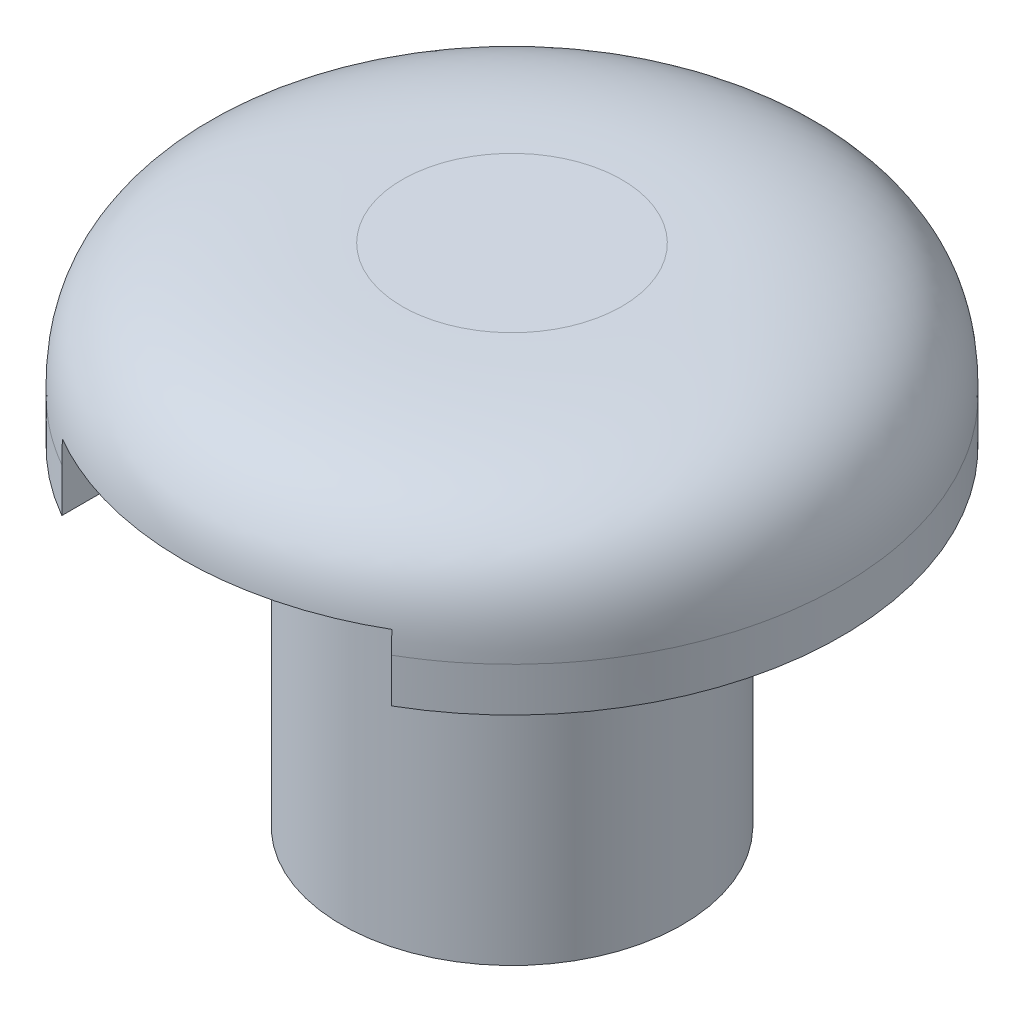
ISO-10303-21;
HEADER;
FILE_DESCRIPTION(('STEP AP214'),'2;1');
FILE_NAME('part.step','',(''),(''),'','','');
FILE_SCHEMA(('AUTOMOTIVE_DESIGN { 1 0 10303 214 1 1 1 1 }'));
ENDSEC;
DATA;
#1=APPLICATION_CONTEXT('core data for automotive mechanical design processes');
#2=APPLICATION_PROTOCOL_DEFINITION('international standard','automotive_design',2000,#1);
#3=PRODUCT_CONTEXT('',#1,'mechanical');
#4=PRODUCT('Part','Part','',(#3));
#5=PRODUCT_RELATED_PRODUCT_CATEGORY('part','',(#4));
#6=PRODUCT_DEFINITION_FORMATION('','',#4);
#7=PRODUCT_DEFINITION_CONTEXT('part definition',#1,'design');
#8=PRODUCT_DEFINITION('design','',#6,#7);
#9=PRODUCT_DEFINITION_SHAPE('','',#8);
#10=(LENGTH_UNIT() NAMED_UNIT(*) SI_UNIT(.MILLI.,.METRE.));
#11=(NAMED_UNIT(*) PLANE_ANGLE_UNIT() SI_UNIT($,.RADIAN.));
#12=(NAMED_UNIT(*) SI_UNIT($,.STERADIAN.) SOLID_ANGLE_UNIT());
#13=UNCERTAINTY_MEASURE_WITH_UNIT(LENGTH_MEASURE(1.E-05),#10,'distance_accuracy_value','');
#14=(GEOMETRIC_REPRESENTATION_CONTEXT(3) GLOBAL_UNCERTAINTY_ASSIGNED_CONTEXT((#13)) GLOBAL_UNIT_ASSIGNED_CONTEXT((#10,
#11,#12)) REPRESENTATION_CONTEXT('',''));
#15=CARTESIAN_POINT('',(0.,0.,0.));
#16=DIRECTION('',(0.,0.,1.));
#17=DIRECTION('',(1.,0.,0.));
#18=AXIS2_PLACEMENT_3D('',#15,#16,#17);
#19=CARTESIAN_POINT('',(0.,8.,0.));
#20=DIRECTION('',(0.,-1.,0.));
#21=DIRECTION('',(0.,0.,-1.));
#22=AXIS2_PLACEMENT_3D('',#19,#20,#21);
#23=CYLINDRICAL_SURFACE('',#22,15.);
#24=CARTESIAN_POINT('',(0.,2.,15.));
#25=CARTESIAN_POINT('',(1.96323118707497,2.,15.));
#26=CARTESIAN_POINT('',(5.88969356122492,2.,14.2189780737307));
#27=CARTESIAN_POINT('',(10.8827346679584,2.,10.8827346679584));
#28=CARTESIAN_POINT('',(14.2189780737307,2.,5.8896935612249));
#29=CARTESIAN_POINT('',(15.3905109631347,2.,0.));
#30=CARTESIAN_POINT('',(14.2189780737307,2.,-5.88969356122492));
#31=CARTESIAN_POINT('',(10.8827346679584,2.,-10.8827346679584));
#32=CARTESIAN_POINT('',(5.88969356122496,2.,-14.2189780737307));
#33=CARTESIAN_POINT('',(0.,2.,-15.3905109631347));
#34=CARTESIAN_POINT('',(-5.88969356122487,2.,-14.2189780737307));
#35=CARTESIAN_POINT('',(-10.8827346679585,2.,-10.8827346679584));
#36=CARTESIAN_POINT('',(-14.2189780737307,2.,-5.88969356122496));
#37=CARTESIAN_POINT('',(-15.3905109631347,2.,0.));
#38=CARTESIAN_POINT('',(-14.2189780737307,2.,5.88969356122487));
#39=CARTESIAN_POINT('',(-10.8827346679585,2.,10.8827346679584));
#40=CARTESIAN_POINT('',(-5.88969356122493,2.,14.2189780737307));
#41=CARTESIAN_POINT('',(-1.96323118707497,2.,15.));
#42=CARTESIAN_POINT('',(0.,2.,15.));
#43=B_SPLINE_CURVE_WITH_KNOTS('',3,(#24,#25,#26,#27,#28,#29,#30,#31,#32,#33,#34,#35,#36,#37,#38,
#39,#40,#41,#42),.UNSPECIFIED.,.T.,.F.,(4,1,1,1,1,1,1,1,1,1,1,1,1,1,1,1,4),(0.,
0.392699081698724,0.785398163397448,1.17809724509617,1.5707963267949,1.96349540849362,
2.35619449019234,2.74889357189107,3.14159265358979,3.53429173528852,3.92699081698724,
4.31968989868597,4.71238898038469,5.10508806208341,5.49778714378214,5.89048622548086,
6.28318530717959),.UNSPECIFIED.);
#44=CARTESIAN_POINT('',(-7.49999993406031,2.,12.9897213749177));
#45=VERTEX_POINT('',#44);
#46=CARTESIAN_POINT('',(7.49999993406189,2.,12.989721374916));
#47=VERTEX_POINT('',#46);
#48=EDGE_CURVE('E190',#45,#47,#43,.F.);
#49=ORIENTED_EDGE('',*,*,#48,.T.);
#50=DIRECTION('',(0.,-1.,0.));
#51=VECTOR('',#50,1.);
#52=CARTESIAN_POINT('',(7.5,8.,12.9903810567666));
#53=LINE('',#52,#51);
#54=CARTESIAN_POINT('',(7.5,0.,12.9903810567666));
#55=VERTEX_POINT('',#54);
#56=EDGE_CURVE('E146',#47,#55,#53,.T.);
#57=ORIENTED_EDGE('',*,*,#56,.T.);
#58=CARTESIAN_POINT('',(0.,0.,0.));
#59=DIRECTION('',(0.,1.,0.));
#60=DIRECTION('',(0.,0.,1.));
#61=AXIS2_PLACEMENT_3D('',#58,#59,#60);
#62=CIRCLE('',#61,15.);
#63=CARTESIAN_POINT('',(-7.5,0.,12.9903810567666));
#64=VERTEX_POINT('',#63);
#65=EDGE_CURVE('E151',#55,#64,#62,.T.);
#66=ORIENTED_EDGE('',*,*,#65,.T.);
#67=DIRECTION('',(0.,-1.,0.));
#68=VECTOR('',#67,1.);
#69=CARTESIAN_POINT('',(-7.5,8.,12.9903810567666));
#70=LINE('',#69,#68);
#71=EDGE_CURVE('E138',#64,#45,#70,.F.);
#72=ORIENTED_EDGE('',*,*,#71,.T.);
#73=EDGE_LOOP('',(#49,#57,#66,#72));
#74=FACE_BOUND('',#73,.T.);
#75=ADVANCED_FACE('F37',(#74),#23,.T.);
#76=CARTESIAN_POINT('',(0.,8.,0.));
#77=DIRECTION('',(0.,1.,0.));
#78=DIRECTION('',(0.,0.,1.));
#79=AXIS2_PLACEMENT_3D('',#76,#77,#78);
#80=PLANE('',#79);
#81=CARTESIAN_POINT('',(0.,8.,5.));
#82=CARTESIAN_POINT('',(-0.654410395691658,8.,5.));
#83=CARTESIAN_POINT('',(-1.96323118707498,8.,4.73965935791023));
#84=CARTESIAN_POINT('',(-3.62757822265282,8.,3.6275782226528));
#85=CARTESIAN_POINT('',(-4.73965935791023,8.,1.96323118707496));
#86=CARTESIAN_POINT('',(-5.13017032104489,8.,0.));
#87=CARTESIAN_POINT('',(-4.73965935791022,8.,-1.96323118707499));
#88=CARTESIAN_POINT('',(-3.62757822265281,8.,-3.6275782226528));
#89=CARTESIAN_POINT('',(-1.96323118707496,8.,-4.73965935791023));
#90=CARTESIAN_POINT('',(0.,8.,-5.13017032104488));
#91=CARTESIAN_POINT('',(1.96323118707499,8.00000000000001,-4.73965935791022));
#92=CARTESIAN_POINT('',(3.6275782226528,8.,-3.62757822265281));
#93=CARTESIAN_POINT('',(4.73965935791023,8.,-1.96323118707497));
#94=CARTESIAN_POINT('',(5.13017032104488,8.,0.));
#95=CARTESIAN_POINT('',(4.73965935791023,8.,1.96323118707497));
#96=CARTESIAN_POINT('',(3.62757822265281,8.,3.62757822265281));
#97=CARTESIAN_POINT('',(1.96323118707497,8.,4.73965935791023));
#98=CARTESIAN_POINT('',(0.654410395691658,8.,5.));
#99=CARTESIAN_POINT('',(0.,8.,5.));
#100=B_SPLINE_CURVE_WITH_KNOTS('',3,(#81,#82,#83,#84,#85,#86,#87,#88,#89,#90,#91,#92,#93,#94,
#95,#96,#97,#98,#99),.UNSPECIFIED.,.T.,.F.,(4,1,1,1,1,1,1,1,1,1,1,1,1,1,1,1,4),(0.,
0.392699081698724,0.785398163397448,1.17809724509617,1.5707963267949,1.96349540849362,
2.35619449019235,2.74889357189107,3.14159265358979,3.53429173528852,3.92699081698724,
4.31968989868597,4.71238898038469,5.10508806208341,5.49778714378214,5.89048622548086,
6.28318530717959),.UNSPECIFIED.);
#101=CARTESIAN_POINT('',(0.,8.,5.));
#102=VERTEX_POINT('',#101);
#103=EDGE_CURVE('E156',#102,#102,#100,.F.);
#104=ORIENTED_EDGE('',*,*,#103,.T.);
#105=EDGE_LOOP('',(#104));
#106=FACE_BOUND('',#105,.T.);
#107=ADVANCED_FACE('F168',(#106),#80,.T.);
#108=CARTESIAN_POINT('',(0.,0.,0.));
#109=DIRECTION('',(0.,1.,0.));
#110=DIRECTION('',(0.,0.,1.));
#111=AXIS2_PLACEMENT_3D('',#108,#109,#110);
#112=PLANE('',#111);
#113=CARTESIAN_POINT('',(11.5,0.,0.));
#114=DIRECTION('',(0.,-1.,0.));
#115=DIRECTION('',(0.,0.,-1.));
#116=AXIS2_PLACEMENT_3D('',#113,#114,#115);
#117=CIRCLE('',#116,3.);
#118=CARTESIAN_POINT('',(11.5,0.,-3.));
#119=VERTEX_POINT('',#118);
#120=EDGE_CURVE('E127',#119,#119,#117,.T.);
#121=ORIENTED_EDGE('',*,*,#120,.F.);
#122=EDGE_LOOP('',(#121));
#123=FACE_BOUND('',#122,.T.);
#124=CARTESIAN_POINT('',(-11.5,0.,0.));
#125=DIRECTION('',(0.,-1.,0.));
#126=DIRECTION('',(0.,0.,-1.));
#127=AXIS2_PLACEMENT_3D('',#124,#125,#126);
#128=CIRCLE('',#127,3.);
#129=CARTESIAN_POINT('',(-11.5,0.,-3.));
#130=VERTEX_POINT('',#129);
#131=EDGE_CURVE('E257',#130,#130,#128,.T.);
#132=ORIENTED_EDGE('',*,*,#131,.F.);
#133=EDGE_LOOP('',(#132));
#134=FACE_BOUND('',#133,.T.);
#135=CARTESIAN_POINT('',(0.,0.,0.));
#136=DIRECTION('',(0.,-1.,0.));
#137=DIRECTION('',(0.,0.,-1.));
#138=AXIS2_PLACEMENT_3D('',#135,#136,#137);
#139=CIRCLE('',#138,7.75);
#140=CARTESIAN_POINT('',(-3.32603367391252,0.,7.));
#141=VERTEX_POINT('',#140);
#142=CARTESIAN_POINT('',(3.32603367391252,0.,7.));
#143=VERTEX_POINT('',#142);
#144=EDGE_CURVE('E12',#141,#143,#139,.T.);
#145=ORIENTED_EDGE('',*,*,#144,.F.);
#146=DIRECTION('',(1.,0.,0.));
#147=VECTOR('',#146,1.);
#148=CARTESIAN_POINT('',(-7.5,0.,7.));
#149=LINE('',#148,#147);
#150=CARTESIAN_POINT('',(-7.5,0.,7.));
#151=VERTEX_POINT('',#150);
#152=EDGE_CURVE('E108',#151,#141,#149,.T.);
#153=ORIENTED_EDGE('',*,*,#152,.F.);
#154=DIRECTION('',(0.,0.,1.));
#155=VECTOR('',#154,1.);
#156=CARTESIAN_POINT('',(-7.5,0.,7.));
#157=LINE('',#156,#155);
#158=EDGE_CURVE('E140',#151,#64,#157,.T.);
#159=ORIENTED_EDGE('',*,*,#158,.T.);
#160=ORIENTED_EDGE('',*,*,#65,.F.);
#161=DIRECTION('',(0.,0.,1.));
#162=VECTOR('',#161,1.);
#163=CARTESIAN_POINT('',(7.5,0.,7.));
#164=LINE('',#163,#162);
#165=CARTESIAN_POINT('',(7.5,0.,7.));
#166=VERTEX_POINT('',#165);
#167=EDGE_CURVE('E116',#166,#55,#164,.T.);
#168=ORIENTED_EDGE('',*,*,#167,.F.);
#169=EDGE_CURVE('E105',#143,#166,#149,.T.);
#170=ORIENTED_EDGE('',*,*,#169,.F.);
#171=EDGE_LOOP('',(#145,#153,#159,#160,#168,#170));
#172=FACE_BOUND('',#171,.T.);
#173=ADVANCED_FACE('F114',(#123,#134,#172),#112,.F.);
#174=CARTESIAN_POINT('',(0.,8.,5.));
#175=CARTESIAN_POINT('',(0.654410395691658,8.,5.));
#176=CARTESIAN_POINT('',(1.96323118707497,8.,4.73965935791023));
#177=CARTESIAN_POINT('',(3.62757822265281,8.,3.62757822265281));
#178=CARTESIAN_POINT('',(4.73965935791023,8.,1.96323118707497));
#179=CARTESIAN_POINT('',(5.13017032104488,8.,0.));
#180=CARTESIAN_POINT('',(4.73965935791023,8.,-1.96323118707497));
#181=CARTESIAN_POINT('',(3.6275782226528,8.,-3.62757822265281));
#182=CARTESIAN_POINT('',(1.96323118707499,8.00000000000001,-4.73965935791022));
#183=CARTESIAN_POINT('',(0.,8.,-5.13017032104488));
#184=CARTESIAN_POINT('',(-1.96323118707496,8.,-4.73965935791023));
#185=CARTESIAN_POINT('',(-3.62757822265281,8.,-3.6275782226528));
#186=CARTESIAN_POINT('',(-4.73965935791022,8.,-1.96323118707499));
#187=CARTESIAN_POINT('',(-5.13017032104489,8.,0.));
#188=CARTESIAN_POINT('',(-4.73965935791023,8.,1.96323118707496));
#189=CARTESIAN_POINT('',(-3.62757822265282,8.,3.6275782226528));
#190=CARTESIAN_POINT('',(-1.96323118707498,8.,4.73965935791023));
#191=CARTESIAN_POINT('',(-0.654410395691658,8.,5.));
#192=CARTESIAN_POINT('',(0.,8.,5.));
#193=CARTESIAN_POINT('',(0.,8.,6.68198051533946));
#194=CARTESIAN_POINT('',(0.87455150260945,8.,6.68198051533947));
#195=CARTESIAN_POINT('',(2.62365450782835,8.,6.3340622957805));
#196=CARTESIAN_POINT('',(4.84788140032716,8.,4.84788140032716));
#197=CARTESIAN_POINT('',(6.3340622957805,8.,2.62365450782834));
#198=CARTESIAN_POINT('',(6.85593962511894,8.,0.));
#199=CARTESIAN_POINT('',(6.3340622957805,8.,-2.62365450782835));
#200=CARTESIAN_POINT('',(4.84788140032715,8.,-4.84788140032717));
#201=CARTESIAN_POINT('',(2.62365450782836,8.00000000000001,-6.33406229578049));
#202=CARTESIAN_POINT('',(0.,8.,-6.85593962511894));
#203=CARTESIAN_POINT('',(-2.62365450782833,8.,-6.33406229578051));
#204=CARTESIAN_POINT('',(-4.84788140032718,8.,-4.84788140032715));
#205=CARTESIAN_POINT('',(-6.33406229578049,8.,-2.62365450782836));
#206=CARTESIAN_POINT('',(-6.85593962511895,8.,0.));
#207=CARTESIAN_POINT('',(-6.3340622957805,8.,2.62365450782833));
#208=CARTESIAN_POINT('',(-4.84788140032718,8.,4.84788140032715));
#209=CARTESIAN_POINT('',(-2.62365450782835,8.,6.3340622957805));
#210=CARTESIAN_POINT('',(-0.874551502609449,8.,6.68198051533946));
#211=CARTESIAN_POINT('',(0.,8.,6.68198051533946));
#212=CARTESIAN_POINT('',(0.,8.,8.36396103067893));
#213=CARTESIAN_POINT('',(1.09469260952724,8.,8.36396103067893));
#214=CARTESIAN_POINT('',(3.28407782858172,8.,7.92846523365078));
#215=CARTESIAN_POINT('',(6.06818457800151,8.,6.06818457800152));
#216=CARTESIAN_POINT('',(7.92846523365078,8.,3.28407782858172));
#217=CARTESIAN_POINT('',(8.58170892919301,8.,0.));
#218=CARTESIAN_POINT('',(7.92846523365077,8.,-3.28407782858172));
#219=CARTESIAN_POINT('',(6.06818457800151,8.,-6.06818457800153));
#220=CARTESIAN_POINT('',(3.28407782858174,8.00000000000001,-7.92846523365076));
#221=CARTESIAN_POINT('',(0.,8.,-8.581708929193));
#222=CARTESIAN_POINT('',(-3.2840778285817,8.,-7.92846523365079));
#223=CARTESIAN_POINT('',(-6.06818457800154,8.,-6.06818457800151));
#224=CARTESIAN_POINT('',(-7.92846523365075,8.,-3.28407782858174));
#225=CARTESIAN_POINT('',(-8.58170892919301,8.,0.));
#226=CARTESIAN_POINT('',(-7.92846523365077,8.,3.28407782858169));
#227=CARTESIAN_POINT('',(-6.06818457800154,8.,6.06818457800151));
#228=CARTESIAN_POINT('',(-3.28407782858173,8.,7.92846523365077));
#229=CARTESIAN_POINT('',(-1.09469260952724,8.,8.36396103067893));
#230=CARTESIAN_POINT('',(0.,8.,8.36396103067893));
#231=CARTESIAN_POINT('',(0.,7.5698484809835,12.0710678118655));
#232=CARTESIAN_POINT('',(1.57988645263674,7.5698484809835,12.0710678118655));
#233=CARTESIAN_POINT('',(4.73965935791023,7.5698484809835,11.4425499028954));
#234=CARTESIAN_POINT('',(8.75774854369769,7.5698484809835,8.75774854369769));
#235=CARTESIAN_POINT('',(11.4425499028954,7.5698484809835,4.73965935791022));
#236=CARTESIAN_POINT('',(12.3853267663505,7.5698484809835,0.));
#237=CARTESIAN_POINT('',(11.4425499028954,7.5698484809835,-4.73965935791023));
#238=CARTESIAN_POINT('',(8.75774854369767,7.5698484809835,-8.7577485436977));
#239=CARTESIAN_POINT('',(4.73965935791026,7.5698484809835,-11.4425499028954));
#240=CARTESIAN_POINT('',(0.,7.5698484809835,-12.3853267663505));
#241=CARTESIAN_POINT('',(-4.73965935791019,7.5698484809835,-11.4425499028954));
#242=CARTESIAN_POINT('',(-8.75774854369772,7.5698484809835,-8.75774854369767));
#243=CARTESIAN_POINT('',(-11.4425499028954,7.5698484809835,-4.73965935791026));
#244=CARTESIAN_POINT('',(-12.3853267663505,7.5698484809835,0.));
#245=CARTESIAN_POINT('',(-11.4425499028954,7.5698484809835,4.73965935791019));
#246=CARTESIAN_POINT('',(-8.75774854369772,7.5698484809835,8.75774854369767));
#247=CARTESIAN_POINT('',(-4.73965935791023,7.5698484809835,11.4425499028954));
#248=CARTESIAN_POINT('',(-1.57988645263674,7.5698484809835,12.0710678118655));
#249=CARTESIAN_POINT('',(0.,7.5698484809835,12.0710678118655));
#250=CARTESIAN_POINT('',(0.,6.24264068711929,14.2830808016392));
#251=CARTESIAN_POINT('',(1.86939931181932,6.24264068711929,14.2830808016392));
#252=CARTESIAN_POINT('',(5.60819793545796,6.24264068711929,13.5393875162554));
#253=CARTESIAN_POINT('',(10.3625985736833,6.24264068711928,10.3625985736833));
#254=CARTESIAN_POINT('',(13.5393875162554,6.24264068711929,5.60819793545795));
#255=CARTESIAN_POINT('',(14.6549274443311,6.24264068711928,0.));
#256=CARTESIAN_POINT('',(13.5393875162554,6.24264068711929,-5.60819793545796));
#257=CARTESIAN_POINT('',(10.3625985736833,6.24264068711928,-10.3625985736833));
#258=CARTESIAN_POINT('',(5.608197935458,6.24264068711929,-13.5393875162554));
#259=CARTESIAN_POINT('',(0.,6.24264068711928,-14.654927444331));
#260=CARTESIAN_POINT('',(-5.60819793545792,6.24264068711929,-13.5393875162554));
#261=CARTESIAN_POINT('',(-10.3625985736834,6.24264068711929,-10.3625985736833));
#262=CARTESIAN_POINT('',(-13.5393875162554,6.24264068711928,-5.608197935458));
#263=CARTESIAN_POINT('',(-14.6549274443311,6.24264068711929,0.));
#264=CARTESIAN_POINT('',(-13.5393875162554,6.24264068711929,5.60819793545791));
#265=CARTESIAN_POINT('',(-10.3625985736834,6.24264068711929,10.3625985736833));
#266=CARTESIAN_POINT('',(-5.60819793545797,6.24264068711929,13.5393875162554));
#267=CARTESIAN_POINT('',(-1.86939931181932,6.24264068711929,14.2830808016392));
#268=CARTESIAN_POINT('',(0.,6.24264068711929,14.2830808016392));
#269=CARTESIAN_POINT('',(0.,4.01837661840736,15.));
#270=CARTESIAN_POINT('',(1.96323118707497,4.01837661840736,15.));
#271=CARTESIAN_POINT('',(5.88969356122492,4.01837661840736,14.2189780737307));
#272=CARTESIAN_POINT('',(10.8827346679584,4.01837661840736,10.8827346679584));
#273=CARTESIAN_POINT('',(14.2189780737307,4.01837661840736,5.8896935612249));
#274=CARTESIAN_POINT('',(15.3905109631347,4.01837661840736,0.));
#275=CARTESIAN_POINT('',(14.2189780737307,4.01837661840736,-5.88969356122492));
#276=CARTESIAN_POINT('',(10.8827346679584,4.01837661840736,-10.8827346679584));
#277=CARTESIAN_POINT('',(5.88969356122496,4.01837661840736,-14.2189780737307));
#278=CARTESIAN_POINT('',(0.,4.01837661840736,-15.3905109631347));
#279=CARTESIAN_POINT('',(-5.88969356122487,4.01837661840736,-14.2189780737307));
#280=CARTESIAN_POINT('',(-10.8827346679585,4.01837661840736,-10.8827346679584));
#281=CARTESIAN_POINT('',(-14.2189780737307,4.01837661840735,-5.88969356122496));
#282=CARTESIAN_POINT('',(-15.3905109631347,4.01837661840736,0.));
#283=CARTESIAN_POINT('',(-14.2189780737307,4.01837661840736,5.88969356122487));
#284=CARTESIAN_POINT('',(-10.8827346679585,4.01837661840736,10.8827346679584));
#285=CARTESIAN_POINT('',(-5.88969356122493,4.01837661840736,14.2189780737307));
#286=CARTESIAN_POINT('',(-1.96323118707497,4.01837661840736,15.));
#287=CARTESIAN_POINT('',(0.,4.01837661840736,15.));
#288=CARTESIAN_POINT('',(0.,3.00918830920368,15.));
#289=CARTESIAN_POINT('',(1.96323118707497,3.00918830920368,15.));
#290=CARTESIAN_POINT('',(5.88969356122492,3.00918830920368,14.2189780737307));
#291=CARTESIAN_POINT('',(10.8827346679584,3.00918830920368,10.8827346679584));
#292=CARTESIAN_POINT('',(14.2189780737307,3.00918830920368,5.8896935612249));
#293=CARTESIAN_POINT('',(15.3905109631347,3.00918830920368,0.));
#294=CARTESIAN_POINT('',(14.2189780737307,3.00918830920368,-5.88969356122492));
#295=CARTESIAN_POINT('',(10.8827346679584,3.00918830920368,-10.8827346679584));
#296=CARTESIAN_POINT('',(5.88969356122496,3.00918830920368,-14.2189780737307));
#297=CARTESIAN_POINT('',(0.,3.00918830920368,-15.3905109631347));
#298=CARTESIAN_POINT('',(-5.88969356122487,3.00918830920368,-14.2189780737307));
#299=CARTESIAN_POINT('',(-10.8827346679585,3.00918830920368,-10.8827346679584));
#300=CARTESIAN_POINT('',(-14.2189780737307,3.00918830920368,-5.88969356122496));
#301=CARTESIAN_POINT('',(-15.3905109631347,3.00918830920368,0.));
#302=CARTESIAN_POINT('',(-14.2189780737307,3.00918830920368,5.88969356122487));
#303=CARTESIAN_POINT('',(-10.8827346679585,3.00918830920368,10.8827346679584));
#304=CARTESIAN_POINT('',(-5.88969356122493,3.00918830920368,14.2189780737307));
#305=CARTESIAN_POINT('',(-1.96323118707497,3.00918830920368,15.));
#306=CARTESIAN_POINT('',(0.,3.00918830920368,15.));
#307=CARTESIAN_POINT('',(0.,2.,15.));
#308=CARTESIAN_POINT('',(1.96323118707497,2.,15.));
#309=CARTESIAN_POINT('',(5.88969356122492,2.,14.2189780737307));
#310=CARTESIAN_POINT('',(10.8827346679584,2.,10.8827346679584));
#311=CARTESIAN_POINT('',(14.2189780737307,2.,5.8896935612249));
#312=CARTESIAN_POINT('',(15.3905109631347,2.,0.));
#313=CARTESIAN_POINT('',(14.2189780737307,2.,-5.88969356122492));
#314=CARTESIAN_POINT('',(10.8827346679584,2.,-10.8827346679584));
#315=CARTESIAN_POINT('',(5.88969356122496,2.,-14.2189780737307));
#316=CARTESIAN_POINT('',(0.,2.,-15.3905109631347));
#317=CARTESIAN_POINT('',(-5.88969356122487,2.,-14.2189780737307));
#318=CARTESIAN_POINT('',(-10.8827346679585,2.,-10.8827346679584));
#319=CARTESIAN_POINT('',(-14.2189780737307,2.,-5.88969356122496));
#320=CARTESIAN_POINT('',(-15.3905109631347,2.,0.));
#321=CARTESIAN_POINT('',(-14.2189780737307,2.,5.88969356122487));
#322=CARTESIAN_POINT('',(-10.8827346679585,2.,10.8827346679584));
#323=CARTESIAN_POINT('',(-5.88969356122493,2.,14.2189780737307));
#324=CARTESIAN_POINT('',(-1.96323118707497,2.,15.));
#325=CARTESIAN_POINT('',(0.,2.,15.));
#326=B_SPLINE_SURFACE_WITH_KNOTS('',5,3,((#174,#175,#176,#177,#178,#179,#180,#181,#182,#183,
#184,#185,#186,#187,#188,#189,#190,#191,#192),(#193,#194,#195,#196,#197,#198,#199,#200,#201,
#202,#203,#204,#205,#206,#207,#208,#209,#210,#211),(#212,#213,#214,#215,#216,#217,#218,#219,
#220,#221,#222,#223,#224,#225,#226,#227,#228,#229,#230),(#231,#232,#233,#234,#235,#236,#237,
#238,#239,#240,#241,#242,#243,#244,#245,#246,#247,#248,#249),(#250,#251,#252,#253,#254,#255,
#256,#257,#258,#259,#260,#261,#262,#263,#264,#265,#266,#267,#268),(#269,#270,#271,#272,#273,
#274,#275,#276,#277,#278,#279,#280,#281,#282,#283,#284,#285,#286,#287),(#288,#289,#290,#291,
#292,#293,#294,#295,#296,#297,#298,#299,#300,#301,#302,#303,#304,#305,#306),(#307,#308,#309,
#310,#311,#312,#313,#314,#315,#316,#317,#318,#319,#320,#321,#322,#323,#324,#325)),.UNSPECIFIED.,
.F.,.T.,.F.,(6,2,6),(4,1,1,1,1,1,1,1,1,1,1,1,1,1,1,1,4),(0.,0.5,1.),(0.,0.392699081698724,
0.785398163397448,1.17809724509617,1.5707963267949,1.96349540849362,2.35619449019234,
2.74889357189107,3.14159265358979,3.53429173528852,3.92699081698724,4.31968989868597,
4.71238898038469,5.10508806208341,5.49778714378214,5.89048622548086,6.28318530717959),.UNSPECIFIED.);
#327=CARTESIAN_POINT('',(7.50000000000304,2.,12.9895013959067));
#328=CARTESIAN_POINT('',(7.50000000000109,2.05560843904508,12.989505191278));
#329=CARTESIAN_POINT('',(7.50000000000029,2.11121820831823,12.9895015836433));
#330=CARTESIAN_POINT('',(7.49999999999971,2.22241886690327,12.9892069172228));
#331=CARTESIAN_POINT('',(7.49999999999992,2.27800975653571,12.988915950877));
#332=CARTESIAN_POINT('',(7.50000000000008,2.38917208675453,12.9877744269658));
#333=CARTESIAN_POINT('',(7.50000000000002,2.44474352857871,12.986924018397));
#334=CARTESIAN_POINT('',(7.49999999999998,2.55587802375821,12.9844197108225));
#335=CARTESIAN_POINT('',(7.49999999999998,2.61144107440078,12.9827656848832));
#336=CARTESIAN_POINT('',(7.50000000000001,2.72253491162163,12.9784291912451));
#337=CARTESIAN_POINT('',(7.50000000000004,2.77806569407907,12.9757466127671));
#338=CARTESIAN_POINT('',(7.49999999999996,2.88908247860449,12.9691547287886));
#339=CARTESIAN_POINT('',(7.49999999999987,2.9445684426805,12.9652447898143));
#340=CARTESIAN_POINT('',(7.49999999999965,3.,12.9606232561698));
#341=B_SPLINE_CURVE_WITH_KNOTS('',3,(#327,#328,#329,#330,#331,#332,#333,#334,#335,#336,#337,
#338,#339,#340),.UNSPECIFIED.,.F.,.F.,(4,2,2,2,2,2,4),(0.,0.166827544051511,0.333601439026654,
0.500330934985648,0.667086774857907,0.833860580022236,1.00072060355431),.UNSPECIFIED.);
#342=CARTESIAN_POINT('',(7.5,3.,12.9606232561696));
#343=VERTEX_POINT('',#342);
#344=EDGE_CURVE('E55',#47,#343,#341,.T.);
#345=CARTESIAN_POINT('',(-7.5,3.,12.9606232561696));
#346=CARTESIAN_POINT('',(-7.5,2.94456844268051,12.9652447898142));
#347=CARTESIAN_POINT('',(-7.5,2.88908247860451,12.9691547287885));
#348=CARTESIAN_POINT('',(-7.5,2.77806569407909,12.9757466127671));
#349=CARTESIAN_POINT('',(-7.5,2.72253491162165,12.9784291912451));
#350=CARTESIAN_POINT('',(-7.5,2.61144107440079,12.9827656848832));
#351=CARTESIAN_POINT('',(-7.5,2.55587802375821,12.9844197108224));
#352=CARTESIAN_POINT('',(-7.5,2.44474352857869,12.9869240183971));
#353=CARTESIAN_POINT('',(-7.5,2.38917208675451,12.9877744269659));
#354=CARTESIAN_POINT('',(-7.5,2.27800975653569,12.9889159508769));
#355=CARTESIAN_POINT('',(-7.5,2.22241886690325,12.9892069172224));
#356=CARTESIAN_POINT('',(-7.5,2.11121820831821,12.9895015836436));
#357=CARTESIAN_POINT('',(-7.5,2.05560843904507,12.9895051912792));
#358=CARTESIAN_POINT('',(-7.5,2.,12.9895013959102));
#359=B_SPLINE_CURVE_WITH_KNOTS('',3,(#345,#346,#347,#348,#349,#350,#351,#352,#353,#354,#355,
#356,#357,#358),.UNSPECIFIED.,.F.,.F.,(4,2,2,2,2,2,4),(0.,0.166860023532068,0.333633828696401,
0.500389668568684,0.667119164527689,0.83389305950284,1.00072060355433),.UNSPECIFIED.);
#360=CARTESIAN_POINT('',(-7.5,3.,12.9606232561696));
#361=VERTEX_POINT('',#360);
#362=EDGE_CURVE('E196',#361,#45,#359,.T.);
#363=CARTESIAN_POINT('',(7.5,3.,12.9606232561696));
#364=CARTESIAN_POINT('',(7.2008015679017,3.,13.1339304292798));
#365=CARTESIAN_POINT('',(6.89560466282483,3.,13.2969124113173));
#366=CARTESIAN_POINT('',(6.27472191255538,3.,13.6012715734009));
#367=CARTESIAN_POINT('',(5.95903879193332,3.,13.7426543128144));
#368=CARTESIAN_POINT('',(5.31839794926897,3.,14.0030069243575));
#369=CARTESIAN_POINT('',(4.99343629173056,3.,14.1219671183267));
#370=CARTESIAN_POINT('',(4.33601936340733,3.,14.3371147750598));
#371=CARTESIAN_POINT('',(4.00356280085606,3.,14.433298278826));
#372=CARTESIAN_POINT('',(3.26123675410151,3.,14.6206048388669));
#373=CARTESIAN_POINT('',(2.84997905957404,3.,14.7062737207887));
#374=CARTESIAN_POINT('',(2.02172856634916,3.,14.8430117953161));
#375=CARTESIAN_POINT('',(1.6047352078674,3.,14.8940775859596));
#376=CARTESIAN_POINT('',(0.76766579094651,3.,14.961018342867));
#377=CARTESIAN_POINT('',(0.347588060731717,3.,14.9768725541008));
#378=CARTESIAN_POINT('',(-0.492364039189494,3.,14.9727780450271));
#379=CARTESIAN_POINT('',(-0.912238419397381,3.,14.9528314290088));
#380=CARTESIAN_POINT('',(-1.7498877817242,3.,14.8776788644994));
#381=CARTESIAN_POINT('',(-2.16765470708913,3.,14.822383357934));
#382=CARTESIAN_POINT('',(-2.9971530401562,3.,14.6770283992934));
#383=CARTESIAN_POINT('',(-3.40888340264157,3.,14.5869629989855));
#384=CARTESIAN_POINT('',(-4.2228355747655,3.,14.3727634972284));
#385=CARTESIAN_POINT('',(-4.62506989172916,3.,14.2486772781115));
#386=CARTESIAN_POINT('',(-5.21928547463051,3.,14.0374826830755));
#387=CARTESIAN_POINT('',(-5.41580955088737,3.,13.9629183443654));
#388=CARTESIAN_POINT('',(-5.80549481364721,3.,13.8054859999841));
#389=CARTESIAN_POINT('',(-5.99865644811524,3.,13.7226191105222));
#390=CARTESIAN_POINT('',(-6.30192218075842,3.,13.5848299343123));
#391=CARTESIAN_POINT('',(-6.41324710195796,3.,13.5325722350027));
#392=CARTESIAN_POINT('',(-6.63455316989357,3.,13.4253311941967));
#393=CARTESIAN_POINT('',(-6.74453456536966,3.,13.3703483670632));
#394=CARTESIAN_POINT('',(-6.96293321270007,3.,13.2577813262102));
#395=CARTESIAN_POINT('',(-7.07135269608943,3.,13.2002014394481));
#396=CARTESIAN_POINT('',(-7.28676601289555,3.,13.0823893163938));
#397=CARTESIAN_POINT('',(-7.39375958897419,3.,13.022156609561));
#398=CARTESIAN_POINT('',(-7.49999999999999,3.,12.9606232561696));
#399=B_SPLINE_CURVE_WITH_KNOTS('',3,(#363,#364,#365,#366,#367,#368,#369,#370,#371,#372,#373,
#374,#375,#376,#377,#378,#379,#380,#381,#382,#383,#384,#385,#386,#387,#388,#389,#390,#391,#392,
#393,#394,#395,#396,#397,#398),.UNSPECIFIED.,.F.,.F.,(4,2,2,2,2,2,2,2,2,2,2,2,2,2,2,2,2,4),(0.,
1.03712116838318,2.07397494373287,3.11127523272379,4.14875569100307,5.40750215706881,
6.66637235736375,7.92598438641774,9.18552238083444,10.4482641894362,11.7112221164115,
12.9724115481975,13.6028411828441,14.2331861748727,14.602094792215,14.9709340419594,
15.3391799644523,15.7074914692421),.UNSPECIFIED.);
#400=EDGE_CURVE('E203',#343,#361,#399,.T.);
#401=ORIENTED_EDGE('',*,*,#344,.F.);
#402=ORIENTED_EDGE('',*,*,#48,.F.);
#403=ORIENTED_EDGE('',*,*,#362,.F.);
#404=ORIENTED_EDGE('',*,*,#400,.F.);
#405=EDGE_LOOP('',(#401,#402,#403,#404));
#406=FACE_BOUND('',#405,.T.);
#407=ORIENTED_EDGE('',*,*,#103,.F.);
#408=EDGE_LOOP('',(#407));
#409=FACE_BOUND('',#408,.T.);
#410=ADVANCED_FACE('F40',(#406,#409),#326,.T.);
#411=CARTESIAN_POINT('',(7.5,3.,7.));
#412=DIRECTION('',(1.,0.,0.));
#413=DIRECTION('',(0.,0.,-1.));
#414=AXIS2_PLACEMENT_3D('',#411,#412,#413);
#415=PLANE('',#414);
#416=ORIENTED_EDGE('',*,*,#344,.T.);
#417=DIRECTION('',(0.,0.,1.));
#418=VECTOR('',#417,1.);
#419=CARTESIAN_POINT('',(7.5,3.,7.));
#420=LINE('',#419,#418);
#421=CARTESIAN_POINT('',(7.5,3.,7.));
#422=VERTEX_POINT('',#421);
#423=EDGE_CURVE('E135',#422,#343,#420,.T.);
#424=ORIENTED_EDGE('',*,*,#423,.F.);
#425=DIRECTION('',(0.,1.,0.));
#426=VECTOR('',#425,1.);
#427=CARTESIAN_POINT('',(7.5,3.,7.));
#428=LINE('',#427,#426);
#429=EDGE_CURVE('E133',#166,#422,#428,.T.);
#430=ORIENTED_EDGE('',*,*,#429,.F.);
#431=ORIENTED_EDGE('',*,*,#167,.T.);
#432=ORIENTED_EDGE('',*,*,#56,.F.);
#433=EDGE_LOOP('',(#416,#424,#430,#431,#432));
#434=FACE_BOUND('',#433,.T.);
#435=ADVANCED_FACE('F217',(#434),#415,.F.);
#436=CARTESIAN_POINT('',(-7.5,3.,7.));
#437=DIRECTION('',(-1.,0.,0.));
#438=DIRECTION('',(0.,0.,1.));
#439=AXIS2_PLACEMENT_3D('',#436,#437,#438);
#440=PLANE('',#439);
#441=ORIENTED_EDGE('',*,*,#158,.F.);
#442=DIRECTION('',(0.,-1.,0.));
#443=VECTOR('',#442,1.);
#444=CARTESIAN_POINT('',(-7.5,3.,7.));
#445=LINE('',#444,#443);
#446=CARTESIAN_POINT('',(-7.5,3.,7.));
#447=VERTEX_POINT('',#446);
#448=EDGE_CURVE('E117',#447,#151,#445,.T.);
#449=ORIENTED_EDGE('',*,*,#448,.F.);
#450=DIRECTION('',(0.,0.,1.));
#451=VECTOR('',#450,1.);
#452=CARTESIAN_POINT('',(-7.5,3.,7.));
#453=LINE('',#452,#451);
#454=EDGE_CURVE('E70',#447,#361,#453,.T.);
#455=ORIENTED_EDGE('',*,*,#454,.T.);
#456=ORIENTED_EDGE('',*,*,#362,.T.);
#457=ORIENTED_EDGE('',*,*,#71,.F.);
#458=EDGE_LOOP('',(#441,#449,#455,#456,#457));
#459=FACE_BOUND('',#458,.T.);
#460=ADVANCED_FACE('F214',(#459),#440,.F.);
#461=CARTESIAN_POINT('',(-7.5,3.,7.));
#462=DIRECTION('',(0.,1.,0.));
#463=DIRECTION('',(-1.,0.,0.));
#464=AXIS2_PLACEMENT_3D('',#461,#462,#463);
#465=PLANE('',#464);
#466=ORIENTED_EDGE('',*,*,#400,.T.);
#467=ORIENTED_EDGE('',*,*,#454,.F.);
#468=DIRECTION('',(-1.,0.,0.));
#469=VECTOR('',#468,1.);
#470=CARTESIAN_POINT('',(-7.5,3.,7.));
#471=LINE('',#470,#469);
#472=EDGE_CURVE('E124',#422,#447,#471,.T.);
#473=ORIENTED_EDGE('',*,*,#472,.F.);
#474=ORIENTED_EDGE('',*,*,#423,.T.);
#475=EDGE_LOOP('',(#466,#467,#473,#474));
#476=FACE_BOUND('',#475,.T.);
#477=ADVANCED_FACE('F178',(#476),#465,.F.);
#478=CARTESIAN_POINT('',(0.,0.,7.));
#479=DIRECTION('',(0.,0.,-1.));
#480=DIRECTION('',(-1.,0.,0.));
#481=AXIS2_PLACEMENT_3D('',#478,#479,#480);
#482=PLANE('',#481);
#483=ORIENTED_EDGE('',*,*,#472,.T.);
#484=ORIENTED_EDGE('',*,*,#448,.T.);
#485=ORIENTED_EDGE('',*,*,#152,.T.);
#486=EDGE_CURVE('E101',#141,#143,#149,.T.);
#487=ORIENTED_EDGE('',*,*,#486,.T.);
#488=ORIENTED_EDGE('',*,*,#169,.T.);
#489=ORIENTED_EDGE('',*,*,#429,.T.);
#490=EDGE_LOOP('',(#483,#484,#485,#487,#488,#489));
#491=FACE_BOUND('',#490,.T.);
#492=ADVANCED_FACE('F103',(#491),#482,.F.);
#493=CARTESIAN_POINT('',(0.,-15.,0.));
#494=DIRECTION('',(0.,1.,0.));
#495=DIRECTION('',(0.,0.,1.));
#496=AXIS2_PLACEMENT_3D('',#493,#494,#495);
#497=CYLINDRICAL_SURFACE('',#496,7.75);
#498=CARTESIAN_POINT('',(0.,-15.,0.));
#499=DIRECTION('',(0.,-1.,0.));
#500=DIRECTION('',(0.,0.,-1.));
#501=AXIS2_PLACEMENT_3D('',#498,#499,#500);
#502=CIRCLE('',#501,7.75);
#503=CARTESIAN_POINT('',(0.,-15.,-7.75));
#504=VERTEX_POINT('',#503);
#505=EDGE_CURVE('E121',#504,#504,#502,.T.);
#506=ORIENTED_EDGE('',*,*,#505,.F.);
#507=EDGE_LOOP('',(#506));
#508=FACE_BOUND('',#507,.T.);
#509=EDGE_CURVE('E57',#143,#141,#139,.T.);
#510=ORIENTED_EDGE('',*,*,#509,.T.);
#511=ORIENTED_EDGE('',*,*,#144,.T.);
#512=EDGE_LOOP('',(#510,#511));
#513=FACE_BOUND('',#512,.T.);
#514=ADVANCED_FACE('F119',(#508,#513),#497,.T.);
#515=CARTESIAN_POINT('',(0.,-15.,0.));
#516=DIRECTION('',(0.,-1.,0.));
#517=DIRECTION('',(0.,0.,-1.));
#518=AXIS2_PLACEMENT_3D('',#515,#516,#517);
#519=PLANE('',#518);
#520=ORIENTED_EDGE('',*,*,#505,.T.);
#521=EDGE_LOOP('',(#520));
#522=FACE_BOUND('',#521,.T.);
#523=ADVANCED_FACE('F226',(#522),#519,.T.);
#524=CARTESIAN_POINT('',(0.,0.,0.));
#525=DIRECTION('',(0.,-1.,0.));
#526=DIRECTION('',(0.,0.,-1.));
#527=AXIS2_PLACEMENT_3D('',#524,#525,#526);
#528=PLANE('',#527);
#529=ORIENTED_EDGE('',*,*,#486,.F.);
#530=ORIENTED_EDGE('',*,*,#509,.F.);
#531=EDGE_LOOP('',(#529,#530));
#532=FACE_BOUND('',#531,.T.);
#533=ADVANCED_FACE('F120',(#532),#528,.F.);
#534=CARTESIAN_POINT('',(-11.5,4.5,0.));
#535=DIRECTION('',(0.,-1.,0.));
#536=DIRECTION('',(0.,0.,-1.));
#537=AXIS2_PLACEMENT_3D('',#534,#535,#536);
#538=CYLINDRICAL_SURFACE('',#537,3.);
#539=CARTESIAN_POINT('',(-11.5,4.5,0.));
#540=DIRECTION('',(0.,-1.,0.));
#541=DIRECTION('',(0.,0.,-1.));
#542=AXIS2_PLACEMENT_3D('',#539,#540,#541);
#543=CIRCLE('',#542,3.);
#544=CARTESIAN_POINT('',(-11.5,4.5,-3.));
#545=VERTEX_POINT('',#544);
#546=EDGE_CURVE('E254',#545,#545,#543,.T.);
#547=ORIENTED_EDGE('',*,*,#546,.F.);
#548=EDGE_LOOP('',(#547));
#549=FACE_BOUND('',#548,.T.);
#550=ORIENTED_EDGE('',*,*,#131,.T.);
#551=EDGE_LOOP('',(#550));
#552=FACE_BOUND('',#551,.T.);
#553=ADVANCED_FACE('F230',(#549,#552),#538,.F.);
#554=CARTESIAN_POINT('',(-11.5,4.5,0.));
#555=DIRECTION('',(0.,-1.,0.));
#556=DIRECTION('',(0.,0.,-1.));
#557=AXIS2_PLACEMENT_3D('',#554,#555,#556);
#558=PLANE('',#557);
#559=ORIENTED_EDGE('',*,*,#546,.T.);
#560=EDGE_LOOP('',(#559));
#561=FACE_BOUND('',#560,.T.);
#562=ADVANCED_FACE('F236',(#561),#558,.T.);
#563=CARTESIAN_POINT('',(11.5,4.5,0.));
#564=DIRECTION('',(0.,-1.,0.));
#565=DIRECTION('',(0.,0.,-1.));
#566=AXIS2_PLACEMENT_3D('',#563,#564,#565);
#567=CYLINDRICAL_SURFACE('',#566,3.);
#568=CARTESIAN_POINT('',(11.5,4.5,0.));
#569=DIRECTION('',(0.,-1.,0.));
#570=DIRECTION('',(0.,0.,-1.));
#571=AXIS2_PLACEMENT_3D('',#568,#569,#570);
#572=CIRCLE('',#571,3.);
#573=CARTESIAN_POINT('',(11.5,4.5,-3.));
#574=VERTEX_POINT('',#573);
#575=EDGE_CURVE('E122',#574,#574,#572,.T.);
#576=ORIENTED_EDGE('',*,*,#575,.F.);
#577=EDGE_LOOP('',(#576));
#578=FACE_BOUND('',#577,.T.);
#579=ORIENTED_EDGE('',*,*,#120,.T.);
#580=EDGE_LOOP('',(#579));
#581=FACE_BOUND('',#580,.T.);
#582=ADVANCED_FACE('F240',(#578,#581),#567,.F.);
#583=CARTESIAN_POINT('',(11.5,4.5,0.));
#584=DIRECTION('',(0.,-1.,0.));
#585=DIRECTION('',(0.,0.,-1.));
#586=AXIS2_PLACEMENT_3D('',#583,#584,#585);
#587=PLANE('',#586);
#588=ORIENTED_EDGE('',*,*,#575,.T.);
#589=EDGE_LOOP('',(#588));
#590=FACE_BOUND('',#589,.T.);
#591=ADVANCED_FACE('F244',(#590),#587,.T.);
#592=CLOSED_SHELL('',(#75,#107,#173,#410,#435,#460,#477,#492,#514,#523,#533,#553,#562,#582,#591));
#593=MANIFOLD_SOLID_BREP('B2',#592);
#594=ADVANCED_BREP_SHAPE_REPRESENTATION('',(#18,#593),#14);
#595=SHAPE_DEFINITION_REPRESENTATION(#9,#594);
ENDSEC;
END-ISO-10303-21;
